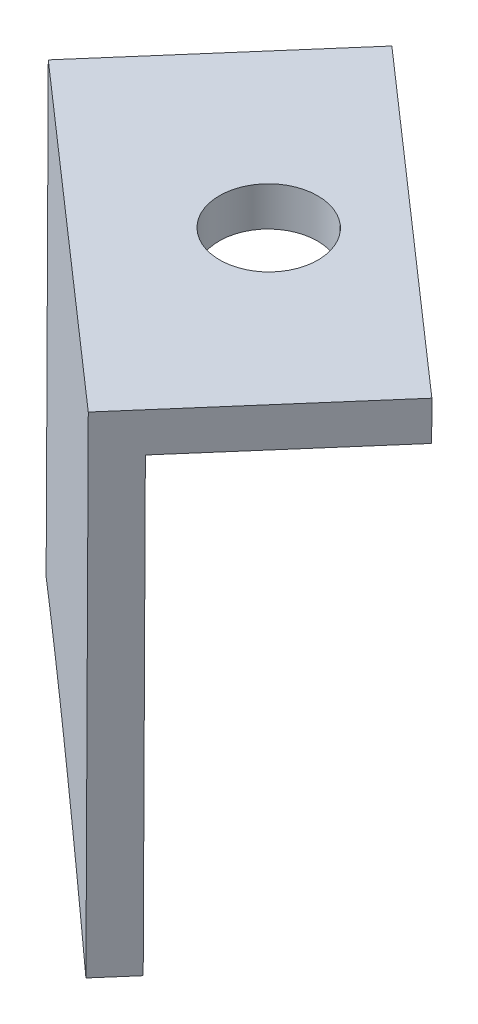
ISO-10303-21;
HEADER;
FILE_DESCRIPTION(('STEP AP214'),'2;1');
FILE_NAME('part.step','',(''),(''),'','','');
FILE_SCHEMA(('AUTOMOTIVE_DESIGN { 1 0 10303 214 1 1 1 1 }'));
ENDSEC;
DATA;
#1=APPLICATION_CONTEXT('core data for automotive mechanical design processes');
#2=APPLICATION_PROTOCOL_DEFINITION('international standard','automotive_design',2000,#1);
#3=PRODUCT_CONTEXT('',#1,'mechanical');
#4=PRODUCT('Part','Part','',(#3));
#5=PRODUCT_RELATED_PRODUCT_CATEGORY('part','',(#4));
#6=PRODUCT_DEFINITION_FORMATION('','',#4);
#7=PRODUCT_DEFINITION_CONTEXT('part definition',#1,'design');
#8=PRODUCT_DEFINITION('design','',#6,#7);
#9=PRODUCT_DEFINITION_SHAPE('','',#8);
#10=(LENGTH_UNIT() NAMED_UNIT(*) SI_UNIT(.MILLI.,.METRE.));
#11=(NAMED_UNIT(*) PLANE_ANGLE_UNIT() SI_UNIT($,.RADIAN.));
#12=(NAMED_UNIT(*) SI_UNIT($,.STERADIAN.) SOLID_ANGLE_UNIT());
#13=UNCERTAINTY_MEASURE_WITH_UNIT(LENGTH_MEASURE(1.E-05),#10,'distance_accuracy_value','');
#14=(GEOMETRIC_REPRESENTATION_CONTEXT(3) GLOBAL_UNCERTAINTY_ASSIGNED_CONTEXT((#13)) GLOBAL_UNIT_ASSIGNED_CONTEXT((#10,
#11,#12)) REPRESENTATION_CONTEXT('',''));
#15=CARTESIAN_POINT('',(0.,0.,0.));
#16=DIRECTION('',(0.,0.,1.));
#17=DIRECTION('',(1.,0.,0.));
#18=AXIS2_PLACEMENT_3D('',#15,#16,#17);
#19=CARTESIAN_POINT('',(750.093756184911,-334.295962545442,277.678651940476));
#20=DIRECTION('',(0.656059028990509,0.,-0.754709580222771));
#21=DIRECTION('',(-0.754709580222771,0.,-0.656059028990509));
#22=AXIS2_PLACEMENT_3D('',#19,#20,#21);
#23=PLANE('',#22);
#24=DIRECTION('',(0.0352646019307498,0.998907741341904,0.0306550507727672));
#25=VECTOR('',#24,1.);
#26=CARTESIAN_POINT('',(715.727479861596,-311.023047122517,247.80450370449));
#27=LINE('',#26,#25);
#28=CARTESIAN_POINT('',(715.727479861596,-311.023047122517,247.80450370449));
#29=VERTEX_POINT('',#28);
#30=CARTESIAN_POINT('',(716.462199431298,-290.211325857889,248.443185682446));
#31=VERTEX_POINT('',#30);
#32=EDGE_CURVE('E52',#29,#31,#27,.T.);
#33=ORIENTED_EDGE('',*,*,#32,.T.);
#34=DIRECTION('',(-0.753885242149403,0.0467260557635072,-0.655342442835897));
#35=VECTOR('',#34,1.);
#36=CARTESIAN_POINT('',(731.539904274281,-291.14584697316,261.55003453917));
#37=LINE('',#36,#35);
#38=CARTESIAN_POINT('',(731.539904274281,-291.14584697316,261.55003453917));
#39=VERTEX_POINT('',#38);
#40=EDGE_CURVE('E138',#39,#31,#37,.T.);
#41=ORIENTED_EDGE('',*,*,#40,.F.);
#42=DIRECTION('',(-0.0352646019306432,-0.998907741341911,-0.0306550507726731));
#43=VECTOR('',#42,1.);
#44=CARTESIAN_POINT('',(730.728818429882,-314.120725024025,260.844968371392));
#45=LINE('',#44,#43);
#46=CARTESIAN_POINT('',(730.728818429882,-314.120725024025,260.844968371392));
#47=VERTEX_POINT('',#46);
#48=EDGE_CURVE('E58',#39,#47,#45,.T.);
#49=ORIENTED_EDGE('',*,*,#48,.T.);
#50=CARTESIAN_POINT('',(704.259954101187,-317.244408189375,237.8359356454));
#51=CARTESIAN_POINT('',(699.15959886763,-341.313661117389,233.402264482718));
#52=CARTESIAN_POINT('',(744.993400951354,-358.365215473456,273.244980777793));
#53=CARTESIAN_POINT('',(750.093756184911,-334.295962545442,277.678651940476));
#54=CARTESIAN_POINT('',(755.194111418468,-310.226709617428,282.112323103158));
#55=CARTESIAN_POINT('',(709.360309334744,-293.175155261361,242.269606808083));
#56=CARTESIAN_POINT('',(704.259954101187,-317.244408189375,237.8359356454));
#57=(BOUNDED_CURVE() B_SPLINE_CURVE(3,(#50,#51,#52,#53,#54,#55,#56),.UNSPECIFIED.,.T.,
.F.) B_SPLINE_CURVE_WITH_KNOTS((4,3,4),(0.,0.5,1.),
.UNSPECIFIED.) CURVE() GEOMETRIC_REPRESENTATION_ITEM() RATIONAL_B_SPLINE_CURVE((1.,
0.333333333333333,0.333333333333333,1.,0.333333333333333,0.333333333333333,1.)) REPRESENTATION_ITEM(''));
#58=EDGE_CURVE('E88',#47,#29,#57,.T.);
#59=ORIENTED_EDGE('',*,*,#58,.T.);
#60=EDGE_LOOP('',(#33,#41,#49,#59));
#61=FACE_BOUND('',#60,.T.);
#62=ADVANCED_FACE('F36',(#61),#23,.T.);
#63=DIRECTION('',(-0.656059028990508,0.,0.754709580222771));
#64=VECTOR('',#63,1.);
#65=SURFACE_OF_LINEAR_EXTRUSION('',#57,#64);
#66=CARTESIAN_POINT('',(702.947836043206,-317.244408189375,239.345354805846));
#67=CARTESIAN_POINT('',(697.847480809649,-341.313661117389,234.911683643163));
#68=CARTESIAN_POINT('',(743.681282893373,-358.365215473456,274.754399938238));
#69=CARTESIAN_POINT('',(748.78163812693,-334.295962545442,279.188071100921));
#70=CARTESIAN_POINT('',(753.881993360487,-310.226709617428,283.621742263604));
#71=CARTESIAN_POINT('',(708.048191276763,-293.175155261361,243.779025968529));
#72=CARTESIAN_POINT('',(702.947836043206,-317.244408189375,239.345354805846));
#73=(BOUNDED_CURVE() B_SPLINE_CURVE(3,(#66,#67,#68,#69,#70,#71,#72),.UNSPECIFIED.,.T.,
.F.) B_SPLINE_CURVE_WITH_KNOTS((4,3,4),(0.,0.5,1.),
.UNSPECIFIED.) CURVE() GEOMETRIC_REPRESENTATION_ITEM() RATIONAL_B_SPLINE_CURVE((1.,
0.333333333333333,0.333333333333333,1.,0.333333333333333,0.333333333333333,1.)) REPRESENTATION_ITEM(''));
#74=CARTESIAN_POINT('',(729.416700371901,-314.120725024025,262.354387531837));
#75=VERTEX_POINT('',#74);
#76=CARTESIAN_POINT('',(714.415361803615,-311.023047122517,249.313922864935));
#77=VERTEX_POINT('',#76);
#78=EDGE_CURVE('E94',#75,#77,#73,.T.);
#79=ORIENTED_EDGE('',*,*,#78,.T.);
#80=DIRECTION('',(-0.656059028990508,0.,0.754709580222771));
#81=VECTOR('',#80,1.);
#82=CARTESIAN_POINT('',(715.727479861596,-311.023047122517,247.80450370449));
#83=LINE('',#82,#81);
#84=EDGE_CURVE('E11',#29,#77,#83,.T.);
#85=ORIENTED_EDGE('',*,*,#84,.F.);
#86=ORIENTED_EDGE('',*,*,#58,.F.);
#87=DIRECTION('',(-0.656059028990508,0.,0.754709580222771));
#88=VECTOR('',#87,1.);
#89=CARTESIAN_POINT('',(730.728818429882,-314.120725024025,260.844968371392));
#90=LINE('',#89,#88);
#91=EDGE_CURVE('E80',#47,#75,#90,.T.);
#92=ORIENTED_EDGE('',*,*,#91,.T.);
#93=EDGE_LOOP('',(#79,#85,#86,#92));
#94=FACE_BOUND('',#93,.T.);
#95=ADVANCED_FACE('F38',(#94),#65,.F.);
#96=CARTESIAN_POINT('',(715.727479861596,-311.023047122517,247.80450370449));
#97=DIRECTION('',(0.753885242149425,-0.0467260557635157,0.655342442835872));
#98=DIRECTION('',(0.656059028990509,0.,-0.754709580222771));
#99=AXIS2_PLACEMENT_3D('',#96,#97,#98);
#100=PLANE('',#99);
#101=DIRECTION('',(0.0352646019307498,0.998907741341904,0.0306550507727672));
#102=VECTOR('',#101,1.);
#103=CARTESIAN_POINT('',(714.415361803615,-311.023047122517,249.313922864935));
#104=LINE('',#103,#102);
#105=CARTESIAN_POINT('',(715.220610577178,-288.213510375206,250.013914944437));
#106=VERTEX_POINT('',#105);
#107=EDGE_CURVE('E97',#77,#106,#104,.T.);
#108=ORIENTED_EDGE('',*,*,#107,.T.);
#109=DIRECTION('',(-0.656059028990508,0.,0.754709580222771));
#110=VECTOR('',#109,1.);
#111=CARTESIAN_POINT('',(716.532728635159,-288.213510375206,248.504495783991));
#112=LINE('',#111,#110);
#113=CARTESIAN_POINT('',(723.09331892506,-288.213510375205,240.95739998177));
#114=VERTEX_POINT('',#113);
#115=EDGE_CURVE('E45',#114,#106,#112,.T.);
#116=ORIENTED_EDGE('',*,*,#115,.F.);
#117=DIRECTION('',(-0.0352646019306998,-0.998907741341905,-0.0306550507728036));
#118=VECTOR('',#117,1.);
#119=CARTESIAN_POINT('',(723.09331892506,-288.213510375205,240.95739998177));
#120=LINE('',#119,#118);
#121=CARTESIAN_POINT('',(723.022789721198,-290.211325857889,240.896089880225));
#122=VERTEX_POINT('',#121);
#123=EDGE_CURVE('E125',#114,#122,#120,.T.);
#124=ORIENTED_EDGE('',*,*,#123,.T.);
#125=DIRECTION('',(-0.656059028990536,0.,0.754709580222747));
#126=VECTOR('',#125,1.);
#127=CARTESIAN_POINT('',(723.022789721198,-290.211325857889,240.896089880225));
#128=LINE('',#127,#126);
#129=EDGE_CURVE('E98',#122,#31,#128,.T.);
#130=ORIENTED_EDGE('',*,*,#129,.T.);
#131=ORIENTED_EDGE('',*,*,#32,.F.);
#132=ORIENTED_EDGE('',*,*,#84,.T.);
#133=EDGE_LOOP('',(#108,#116,#124,#130,#131,#132));
#134=FACE_BOUND('',#133,.T.);
#135=ADVANCED_FACE('F123',(#134),#100,.F.);
#136=CARTESIAN_POINT('',(731.610433478148,-289.148031490476,261.611344640709));
#137=DIRECTION('',(-0.0352646019307445,-0.998907741341905,-0.0306550507727648));
#138=DIRECTION('',(0.999377425254299,-0.0352811832580467,0.));
#139=AXIS2_PLACEMENT_3D('',#136,#137,#138);
#140=PLANE('',#139);
#141=CARTESIAN_POINT('',(727.351876201601,-288.680770932841,251.284372311243));
#142=DIRECTION('',(-0.0352646019307445,-0.998907741341905,-0.0306550507727648));
#143=DIRECTION('',(0.999377425254299,-0.0352811832580467,0.));
#144=AXIS2_PLACEMENT_3D('',#141,#142,#143);
#145=CIRCLE('',#144,2.49999999999983);
#146=CARTESIAN_POINT('',(729.850319764736,-288.768973890986,251.284372311243));
#147=VERTEX_POINT('',#146);
#148=EDGE_CURVE('E145',#147,#147,#145,.T.);
#149=ORIENTED_EDGE('',*,*,#148,.T.);
#150=EDGE_LOOP('',(#149));
#151=FACE_BOUND('',#150,.T.);
#152=DIRECTION('',(0.753885242149426,-0.0467260557635101,0.655342442835871));
#153=VECTOR('',#152,1.);
#154=CARTESIAN_POINT('',(730.298315420167,-289.148031490476,263.120763801154));
#155=LINE('',#154,#153);
#156=CARTESIAN_POINT('',(730.298315420167,-289.148031490476,263.120763801154));
#157=VERTEX_POINT('',#156);
#158=EDGE_CURVE('E89',#106,#157,#155,.T.);
#159=ORIENTED_EDGE('',*,*,#158,.T.);
#160=DIRECTION('',(-0.656059028990508,0.,0.754709580222771));
#161=VECTOR('',#160,1.);
#162=CARTESIAN_POINT('',(731.610433478148,-289.148031490476,261.611344640709));
#163=LINE('',#162,#161);
#164=CARTESIAN_POINT('',(738.171023768048,-289.148031490475,254.064248838488));
#165=VERTEX_POINT('',#164);
#166=EDGE_CURVE('E84',#165,#157,#163,.T.);
#167=ORIENTED_EDGE('',*,*,#166,.F.);
#168=DIRECTION('',(-0.753885242149407,0.0467260557635072,-0.655342442835892));
#169=VECTOR('',#168,1.);
#170=CARTESIAN_POINT('',(738.171023768048,-289.148031490475,254.064248838488));
#171=LINE('',#170,#169);
#172=EDGE_CURVE('E119',#165,#114,#171,.T.);
#173=ORIENTED_EDGE('',*,*,#172,.T.);
#174=ORIENTED_EDGE('',*,*,#115,.T.);
#175=EDGE_LOOP('',(#159,#167,#173,#174));
#176=FACE_BOUND('',#175,.T.);
#177=ADVANCED_FACE('F116',(#151,#176),#140,.F.);
#178=CARTESIAN_POINT('',(730.728818429882,-314.120725024025,260.844968371392));
#179=DIRECTION('',(-0.75388524214943,0.0467260557633735,-0.655342442835876));
#180=DIRECTION('',(-0.656059028990508,0.,0.754709580222771));
#181=AXIS2_PLACEMENT_3D('',#178,#179,#180);
#182=PLANE('',#181);
#183=DIRECTION('',(-0.0352646019306432,-0.998907741341911,-0.0306550507726731));
#184=VECTOR('',#183,1.);
#185=CARTESIAN_POINT('',(729.416700371901,-314.120725024025,262.354387531837));
#186=LINE('',#185,#184);
#187=EDGE_CURVE('E77',#157,#75,#186,.T.);
#188=ORIENTED_EDGE('',*,*,#187,.T.);
#189=ORIENTED_EDGE('',*,*,#91,.F.);
#190=ORIENTED_EDGE('',*,*,#48,.F.);
#191=DIRECTION('',(-0.656059028990536,0.,0.754709580222747));
#192=VECTOR('',#191,1.);
#193=CARTESIAN_POINT('',(738.100494564186,-291.145846973159,254.002938736943));
#194=LINE('',#193,#192);
#195=CARTESIAN_POINT('',(738.100494564186,-291.145846973159,254.002938736943));
#196=VERTEX_POINT('',#195);
#197=EDGE_CURVE('E101',#196,#39,#194,.T.);
#198=ORIENTED_EDGE('',*,*,#197,.F.);
#199=DIRECTION('',(0.0352646019306988,0.998907741341905,0.0306550507728027));
#200=VECTOR('',#199,1.);
#201=CARTESIAN_POINT('',(738.100494564186,-291.145846973159,254.002938736943));
#202=LINE('',#201,#200);
#203=EDGE_CURVE('E136',#196,#165,#202,.T.);
#204=ORIENTED_EDGE('',*,*,#203,.T.);
#205=ORIENTED_EDGE('',*,*,#166,.T.);
#206=EDGE_LOOP('',(#188,#189,#190,#198,#204,#205));
#207=FACE_BOUND('',#206,.T.);
#208=ADVANCED_FACE('F79',(#207),#182,.F.);
#209=CARTESIAN_POINT('',(748.78163812693,-334.295962545442,279.188071100921));
#210=DIRECTION('',(0.656059028990509,0.,-0.754709580222771));
#211=DIRECTION('',(-0.754709580222771,0.,-0.656059028990509));
#212=AXIS2_PLACEMENT_3D('',#209,#210,#211);
#213=PLANE('',#212);
#214=ORIENTED_EDGE('',*,*,#78,.F.);
#215=ORIENTED_EDGE('',*,*,#187,.F.);
#216=ORIENTED_EDGE('',*,*,#158,.F.);
#217=ORIENTED_EDGE('',*,*,#107,.F.);
#218=EDGE_LOOP('',(#214,#215,#216,#217));
#219=FACE_BOUND('',#218,.T.);
#220=ADVANCED_FACE('F96',(#219),#213,.F.);
#221=CARTESIAN_POINT('',(738.100494564186,-291.145846973159,254.002938736943));
#222=DIRECTION('',(0.0352646019307039,0.998907741341905,0.0306550507728071));
#223=DIRECTION('',(-0.999377425254301,0.0352811832580061,0.));
#224=AXIS2_PLACEMENT_3D('',#221,#222,#223);
#225=PLANE('',#224);
#226=CARTESIAN_POINT('',(727.28134699774,-290.678586415524,251.223062209697));
#227=DIRECTION('',(-0.0352646019307039,-0.998907741341905,-0.0306550507728071));
#228=DIRECTION('',(0.999377425254301,-0.0352811832580061,0.));
#229=AXIS2_PLACEMENT_3D('',#226,#227,#228);
#230=CIRCLE('',#229,2.49999999999983);
#231=CARTESIAN_POINT('',(729.779790560875,-290.766789373669,251.223062209697));
#232=VERTEX_POINT('',#231);
#233=EDGE_CURVE('E232',#232,#232,#230,.T.);
#234=ORIENTED_EDGE('',*,*,#233,.F.);
#235=EDGE_LOOP('',(#234));
#236=FACE_BOUND('',#235,.T.);
#237=ORIENTED_EDGE('',*,*,#40,.T.);
#238=ORIENTED_EDGE('',*,*,#129,.F.);
#239=DIRECTION('',(-0.753885242149403,0.0467260557635072,-0.655342442835897));
#240=VECTOR('',#239,1.);
#241=CARTESIAN_POINT('',(738.100494564186,-291.145846973159,254.002938736943));
#242=LINE('',#241,#240);
#243=EDGE_CURVE('E133',#196,#122,#242,.T.);
#244=ORIENTED_EDGE('',*,*,#243,.F.);
#245=ORIENTED_EDGE('',*,*,#197,.T.);
#246=EDGE_LOOP('',(#237,#238,#244,#245));
#247=FACE_BOUND('',#246,.T.);
#248=ADVANCED_FACE('F154',(#236,#247),#225,.F.);
#249=CARTESIAN_POINT('',(191.922880158915,1.65650143864172E-13,-220.782017957678));
#250=DIRECTION('',(-0.656059028990536,0.,0.754709580222747));
#251=DIRECTION('',(0.,1.,0.));
#252=AXIS2_PLACEMENT_3D('',#249,#250,#251);
#253=PLANE('',#252);
#254=ORIENTED_EDGE('',*,*,#243,.T.);
#255=ORIENTED_EDGE('',*,*,#123,.F.);
#256=ORIENTED_EDGE('',*,*,#172,.F.);
#257=ORIENTED_EDGE('',*,*,#203,.F.);
#258=EDGE_LOOP('',(#254,#255,#256,#257));
#259=FACE_BOUND('',#258,.T.);
#260=ADVANCED_FACE('F130',(#259),#253,.F.);
#261=CARTESIAN_POINT('',(727.633993017047,-280.689509002105,251.529612717425));
#262=DIRECTION('',(-0.0352646019307039,-0.998907741341905,-0.0306550507728071));
#263=DIRECTION('',(0.999377425254301,-0.0352811832580061,0.));
#264=AXIS2_PLACEMENT_3D('',#261,#262,#263);
#265=CYLINDRICAL_SURFACE('',#264,2.49999999999983);
#266=ORIENTED_EDGE('',*,*,#233,.T.);
#267=EDGE_LOOP('',(#266));
#268=FACE_BOUND('',#267,.T.);
#269=ORIENTED_EDGE('',*,*,#148,.F.);
#270=EDGE_LOOP('',(#269));
#271=FACE_BOUND('',#270,.T.);
#272=ADVANCED_FACE('F167',(#268,#271),#265,.F.);
#273=CLOSED_SHELL('',(#62,#95,#135,#177,#208,#220,#248,#260,#272));
#274=MANIFOLD_SOLID_BREP('B2',#273);
#275=ADVANCED_BREP_SHAPE_REPRESENTATION('',(#18,#274),#14);
#276=SHAPE_DEFINITION_REPRESENTATION(#9,#275);
ENDSEC;
END-ISO-10303-21;
